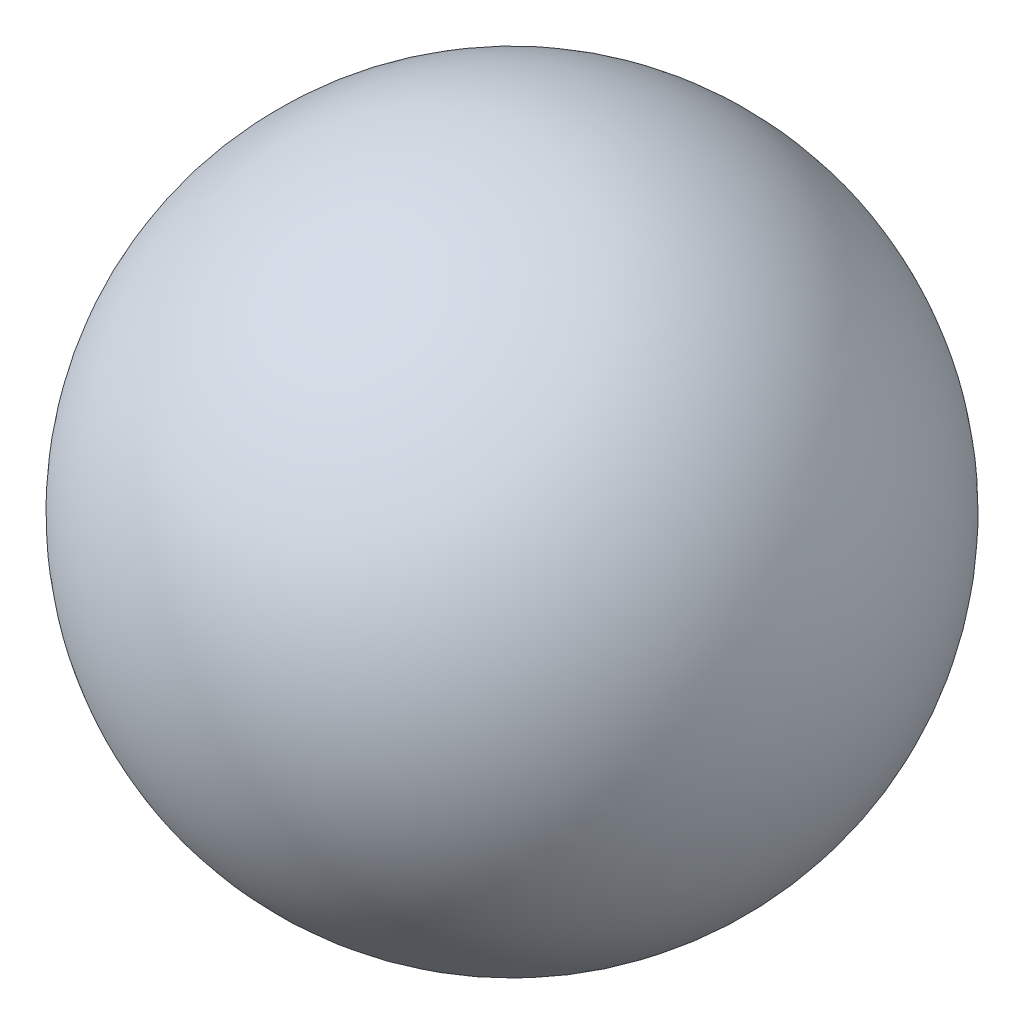
ISO-10303-21;
HEADER;
FILE_DESCRIPTION(('STEP AP214'),'2;1');
FILE_NAME('part.step','',(''),(''),'','','');
FILE_SCHEMA(('AUTOMOTIVE_DESIGN { 1 0 10303 214 1 1 1 1 }'));
ENDSEC;
DATA;
#1=APPLICATION_CONTEXT('core data for automotive mechanical design processes');
#2=APPLICATION_PROTOCOL_DEFINITION('international standard','automotive_design',2000,#1);
#3=PRODUCT_CONTEXT('',#1,'mechanical');
#4=PRODUCT('Part','Part','',(#3));
#5=PRODUCT_RELATED_PRODUCT_CATEGORY('part','',(#4));
#6=PRODUCT_DEFINITION_FORMATION('','',#4);
#7=PRODUCT_DEFINITION_CONTEXT('part definition',#1,'design');
#8=PRODUCT_DEFINITION('design','',#6,#7);
#9=PRODUCT_DEFINITION_SHAPE('','',#8);
#10=(LENGTH_UNIT() NAMED_UNIT(*) SI_UNIT(.MILLI.,.METRE.));
#11=(NAMED_UNIT(*) PLANE_ANGLE_UNIT() SI_UNIT($,.RADIAN.));
#12=(NAMED_UNIT(*) SI_UNIT($,.STERADIAN.) SOLID_ANGLE_UNIT());
#13=UNCERTAINTY_MEASURE_WITH_UNIT(LENGTH_MEASURE(1.E-05),#10,'distance_accuracy_value','');
#14=(GEOMETRIC_REPRESENTATION_CONTEXT(3) GLOBAL_UNCERTAINTY_ASSIGNED_CONTEXT((#13)) GLOBAL_UNIT_ASSIGNED_CONTEXT((#10,
#11,#12)) REPRESENTATION_CONTEXT('',''));
#15=CARTESIAN_POINT('',(0.,0.,0.));
#16=DIRECTION('',(0.,0.,1.));
#17=DIRECTION('',(1.,0.,0.));
#18=AXIS2_PLACEMENT_3D('',#15,#16,#17);
#19=CARTESIAN_POINT('',(-10.1757984944672,-2.,-5.875));
#20=DIRECTION('',(0.,0.,1.));
#21=DIRECTION('',(1.,0.,0.));
#22=AXIS2_PLACEMENT_3D('',#19,#20,#21);
#23=SPHERICAL_SURFACE('',#22,1.05);
#24=CARTESIAN_POINT('',(-10.1757984944672,-2.,-4.825));
#25=VERTEX_POINT('',#24);
#26=VERTEX_LOOP('',#25);
#27=FACE_BOUND('',#26,.T.);
#28=ADVANCED_FACE('F13',(#27),#23,.T.);
#29=CLOSED_SHELL('',(#28));
#30=MANIFOLD_SOLID_BREP('B1',#29);
#31=ADVANCED_BREP_SHAPE_REPRESENTATION('',(#18,#30),#14);
#32=SHAPE_DEFINITION_REPRESENTATION(#9,#31);
ENDSEC;
END-ISO-10303-21;
